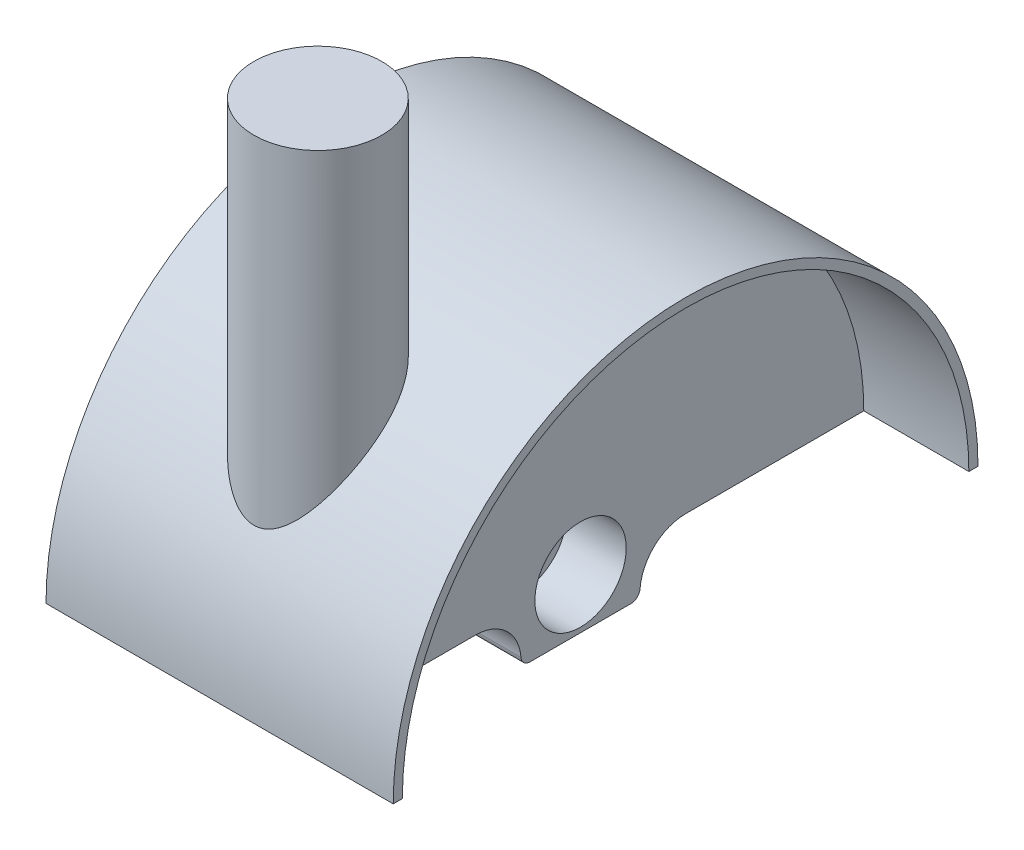
ISO-10303-21;
HEADER;
FILE_DESCRIPTION(('STEP AP214'),'2;1');
FILE_NAME('part.step','',(''),(''),'','','');
FILE_SCHEMA(('AUTOMOTIVE_DESIGN { 1 0 10303 214 1 1 1 1 }'));
ENDSEC;
DATA;
#1=APPLICATION_CONTEXT('core data for automotive mechanical design processes');
#2=APPLICATION_PROTOCOL_DEFINITION('international standard','automotive_design',2000,#1);
#3=PRODUCT_CONTEXT('',#1,'mechanical');
#4=PRODUCT('Part','Part','',(#3));
#5=PRODUCT_RELATED_PRODUCT_CATEGORY('part','',(#4));
#6=PRODUCT_DEFINITION_FORMATION('','',#4);
#7=PRODUCT_DEFINITION_CONTEXT('part definition',#1,'design');
#8=PRODUCT_DEFINITION('design','',#6,#7);
#9=PRODUCT_DEFINITION_SHAPE('','',#8);
#10=(LENGTH_UNIT() NAMED_UNIT(*) SI_UNIT(.MILLI.,.METRE.));
#11=(NAMED_UNIT(*) PLANE_ANGLE_UNIT() SI_UNIT($,.RADIAN.));
#12=(NAMED_UNIT(*) SI_UNIT($,.STERADIAN.) SOLID_ANGLE_UNIT());
#13=UNCERTAINTY_MEASURE_WITH_UNIT(LENGTH_MEASURE(1.E-05),#10,'distance_accuracy_value','');
#14=(GEOMETRIC_REPRESENTATION_CONTEXT(3) GLOBAL_UNCERTAINTY_ASSIGNED_CONTEXT((#13)) GLOBAL_UNIT_ASSIGNED_CONTEXT((#10,
#11,#12)) REPRESENTATION_CONTEXT('',''));
#15=CARTESIAN_POINT('',(0.,0.,0.));
#16=DIRECTION('',(0.,0.,1.));
#17=DIRECTION('',(1.,0.,0.));
#18=AXIS2_PLACEMENT_3D('',#15,#16,#17);
#19=CARTESIAN_POINT('',(0.,-5.,11.5));
#20=DIRECTION('',(-1.,0.,0.));
#21=DIRECTION('',(0.,0.,1.));
#22=AXIS2_PLACEMENT_3D('',#19,#20,#21);
#23=CYLINDRICAL_SURFACE('',#22,5.);
#24=CARTESIAN_POINT('',(-7.5,-5.,11.5));
#25=DIRECTION('',(-1.,0.,0.));
#26=DIRECTION('',(0.,0.,1.));
#27=AXIS2_PLACEMENT_3D('',#24,#25,#26);
#28=CIRCLE('',#27,5.);
#29=CARTESIAN_POINT('',(-7.5,0.,11.5));
#30=VERTEX_POINT('',#29);
#31=CARTESIAN_POINT('',(-7.5,-4.60772935195974,6.51541137718607));
#32=VERTEX_POINT('',#31);
#33=EDGE_CURVE('E206',#30,#32,#28,.T.);
#34=ORIENTED_EDGE('',*,*,#33,.T.);
#35=DIRECTION('',(-1.,0.,0.));
#36=VECTOR('',#35,1.);
#37=CARTESIAN_POINT('',(0.,-4.60772935195974,6.51541137718607));
#38=LINE('',#37,#36);
#39=CARTESIAN_POINT('',(7.5,-4.60772935195974,6.51541137718607));
#40=VERTEX_POINT('',#39);
#41=EDGE_CURVE('E209',#32,#40,#38,.F.);
#42=ORIENTED_EDGE('',*,*,#41,.T.);
#43=CARTESIAN_POINT('',(7.5,-5.,11.5));
#44=DIRECTION('',(1.,0.,0.));
#45=DIRECTION('',(0.,0.,-1.));
#46=AXIS2_PLACEMENT_3D('',#43,#44,#45);
#47=CIRCLE('',#46,5.);
#48=CARTESIAN_POINT('',(7.5,0.,11.5));
#49=VERTEX_POINT('',#48);
#50=EDGE_CURVE('E204',#40,#49,#47,.T.);
#51=ORIENTED_EDGE('',*,*,#50,.T.);
#52=DIRECTION('',(-1.,0.,0.));
#53=VECTOR('',#52,1.);
#54=CARTESIAN_POINT('',(19.,0.,11.5));
#55=LINE('',#54,#53);
#56=EDGE_CURVE('E201',#30,#49,#55,.F.);
#57=ORIENTED_EDGE('',*,*,#56,.F.);
#58=EDGE_LOOP('',(#34,#42,#51,#57));
#59=FACE_BOUND('',#58,.T.);
#60=ADVANCED_FACE('F35',(#59),#23,.F.);
#61=CARTESIAN_POINT('',(0.,-5.,-11.5));
#62=DIRECTION('',(-1.,0.,0.));
#63=DIRECTION('',(0.,0.,1.));
#64=AXIS2_PLACEMENT_3D('',#61,#62,#63);
#65=CYLINDRICAL_SURFACE('',#64,5.);
#66=CARTESIAN_POINT('',(7.5,-5.,-11.5));
#67=DIRECTION('',(1.,0.,0.));
#68=DIRECTION('',(0.,0.,-1.));
#69=AXIS2_PLACEMENT_3D('',#66,#67,#68);
#70=CIRCLE('',#69,5.);
#71=CARTESIAN_POINT('',(7.5,0.,-11.5));
#72=VERTEX_POINT('',#71);
#73=CARTESIAN_POINT('',(7.5,-4.60772935195974,-6.51541137718607));
#74=VERTEX_POINT('',#73);
#75=EDGE_CURVE('E199',#72,#74,#70,.T.);
#76=ORIENTED_EDGE('',*,*,#75,.T.);
#77=DIRECTION('',(-1.,0.,0.));
#78=VECTOR('',#77,1.);
#79=CARTESIAN_POINT('',(0.,-4.60772935195974,-6.51541137718607));
#80=LINE('',#79,#78);
#81=CARTESIAN_POINT('',(-7.5,-4.60772935195974,-6.51541137718607));
#82=VERTEX_POINT('',#81);
#83=EDGE_CURVE('E11',#74,#82,#80,.T.);
#84=ORIENTED_EDGE('',*,*,#83,.T.);
#85=CARTESIAN_POINT('',(-7.5,-5.,-11.5));
#86=DIRECTION('',(-1.,0.,0.));
#87=DIRECTION('',(0.,0.,1.));
#88=AXIS2_PLACEMENT_3D('',#85,#86,#87);
#89=CIRCLE('',#88,5.);
#90=CARTESIAN_POINT('',(-7.5,0.,-11.5));
#91=VERTEX_POINT('',#90);
#92=EDGE_CURVE('E197',#82,#91,#89,.T.);
#93=ORIENTED_EDGE('',*,*,#92,.T.);
#94=DIRECTION('',(1.,0.,0.));
#95=VECTOR('',#94,1.);
#96=CARTESIAN_POINT('',(0.,0.,-11.5));
#97=LINE('',#96,#95);
#98=EDGE_CURVE('E138',#72,#91,#97,.F.);
#99=ORIENTED_EDGE('',*,*,#98,.F.);
#100=EDGE_LOOP('',(#76,#84,#93,#99));
#101=FACE_BOUND('',#100,.T.);
#102=ADVANCED_FACE('F238',(#101),#65,.F.);
#103=CARTESIAN_POINT('',(19.,0.,0.));
#104=DIRECTION('',(0.,1.,0.));
#105=DIRECTION('',(0.,0.,1.));
#106=AXIS2_PLACEMENT_3D('',#103,#104,#105);
#107=PLANE('',#106);
#108=DIRECTION('',(0.,0.,-1.));
#109=VECTOR('',#108,1.);
#110=CARTESIAN_POINT('',(7.5,0.,0.));
#111=LINE('',#110,#109);
#112=CARTESIAN_POINT('',(7.5,0.,-31.));
#113=VERTEX_POINT('',#112);
#114=EDGE_CURVE('E171',#72,#113,#111,.T.);
#115=ORIENTED_EDGE('',*,*,#114,.F.);
#116=ORIENTED_EDGE('',*,*,#98,.T.);
#117=DIRECTION('',(0.,0.,-1.));
#118=VECTOR('',#117,1.);
#119=CARTESIAN_POINT('',(-7.5,0.,0.));
#120=LINE('',#119,#118);
#121=CARTESIAN_POINT('',(-7.5,0.,-31.));
#122=VERTEX_POINT('',#121);
#123=EDGE_CURVE('E130',#91,#122,#120,.T.);
#124=ORIENTED_EDGE('',*,*,#123,.T.);
#125=DIRECTION('',(1.,0.,0.));
#126=VECTOR('',#125,1.);
#127=CARTESIAN_POINT('',(-19.,0.,-31.));
#128=LINE('',#127,#126);
#129=CARTESIAN_POINT('',(-19.,0.,-31.));
#130=VERTEX_POINT('',#129);
#131=EDGE_CURVE('E136',#130,#122,#128,.T.);
#132=ORIENTED_EDGE('',*,*,#131,.F.);
#133=DIRECTION('',(0.,0.,-1.));
#134=VECTOR('',#133,1.);
#135=CARTESIAN_POINT('',(-19.,0.,0.));
#136=LINE('',#135,#134);
#137=CARTESIAN_POINT('',(-19.,0.,-32.));
#138=VERTEX_POINT('',#137);
#139=EDGE_CURVE('E150',#130,#138,#136,.T.);
#140=ORIENTED_EDGE('',*,*,#139,.T.);
#141=DIRECTION('',(-1.,0.,0.));
#142=VECTOR('',#141,1.);
#143=CARTESIAN_POINT('',(19.,0.,-32.));
#144=LINE('',#143,#142);
#145=CARTESIAN_POINT('',(19.,0.,-32.));
#146=VERTEX_POINT('',#145);
#147=EDGE_CURVE('E194',#146,#138,#144,.T.);
#148=ORIENTED_EDGE('',*,*,#147,.F.);
#149=DIRECTION('',(0.,0.,-1.));
#150=VECTOR('',#149,1.);
#151=CARTESIAN_POINT('',(19.,0.,0.));
#152=LINE('',#151,#150);
#153=CARTESIAN_POINT('',(19.,0.,-31.));
#154=VERTEX_POINT('',#153);
#155=EDGE_CURVE('E177',#154,#146,#152,.T.);
#156=ORIENTED_EDGE('',*,*,#155,.F.);
#157=DIRECTION('',(-1.,0.,0.));
#158=VECTOR('',#157,1.);
#159=CARTESIAN_POINT('',(19.,0.,-31.));
#160=LINE('',#159,#158);
#161=EDGE_CURVE('E186',#154,#113,#160,.T.);
#162=ORIENTED_EDGE('',*,*,#161,.T.);
#163=EDGE_LOOP('',(#115,#116,#124,#132,#140,#148,#156,#162));
#164=FACE_BOUND('',#163,.T.);
#165=ADVANCED_FACE('F133',(#164),#107,.F.);
#166=CARTESIAN_POINT('',(19.,0.,0.));
#167=DIRECTION('',(-1.,0.,0.));
#168=DIRECTION('',(0.,0.,1.));
#169=AXIS2_PLACEMENT_3D('',#166,#167,#168);
#170=CYLINDRICAL_SURFACE('',#169,32.);
#171=CARTESIAN_POINT('',(0.,15.0312175155574,28.25));
#172=CARTESIAN_POINT('',(-0.102155093027616,15.0312164653924,28.2500004624133));
#173=CARTESIAN_POINT('',(-0.204300523928058,15.0354353496864,28.2477571562009));
#174=CARTESIAN_POINT('',(-0.407732047794961,15.0521411105847,28.2388584510231));
#175=CARTESIAN_POINT('',(-0.509017855547507,15.0646306304235,28.2322016415334));
#176=CARTESIAN_POINT('',(-0.810595007197943,15.113990202744,28.2058287773547));
#177=CARTESIAN_POINT('',(-1.00847250346679,15.1627504763428,28.1797106256714));
#178=CARTESIAN_POINT('',(-1.44827926941997,15.3042545053188,28.1031636073284));
#179=CARTESIAN_POINT('',(-1.68649273640448,15.4056188473367,28.0479009300075));
#180=CARTESIAN_POINT('',(-2.14189060002036,15.6389286170325,27.9184824837892));
#181=CARTESIAN_POINT('',(-2.35902268554412,15.770947492148,27.8442812956847));
#182=CARTESIAN_POINT('',(-2.74221543034369,16.034364005941,27.6932980735991));
#183=CARTESIAN_POINT('',(-2.91107196082312,16.1629426293954,27.6185355700519));
#184=CARTESIAN_POINT('',(-3.23557003389156,16.4308952637491,27.4599695972697));
#185=CARTESIAN_POINT('',(-3.39120191753828,16.5702770253027,27.376159619719));
#186=CARTESIAN_POINT('',(-3.69069300493788,16.8570089687589,27.2005437547682));
#187=CARTESIAN_POINT('',(-3.83452936748117,17.0043737341061,27.1087230327889));
#188=CARTESIAN_POINT('',(-4.11122986822242,17.3047392127784,26.9179811869915));
#189=CARTESIAN_POINT('',(-4.24409035123991,17.4577417792676,26.8190577181565));
#190=CARTESIAN_POINT('',(-4.58989793716726,17.8771974963481,26.5425301393534));
#191=CARTESIAN_POINT('',(-4.79319698035417,18.1475164820144,26.3586656609386));
#192=CARTESIAN_POINT('',(-5.17311846479317,18.6945615941194,25.9735546564129));
#193=CARTESIAN_POINT('',(-5.34972399138255,18.9712916560093,25.7722972349402));
#194=CARTESIAN_POINT('',(-5.67754026344124,19.5278266052628,25.3532139433377));
#195=CARTESIAN_POINT('',(-5.82872180321128,19.8076346407645,25.1353694304124));
#196=CARTESIAN_POINT('',(-6.1054808869185,20.3672242298335,24.6841118466914));
#197=CARTESIAN_POINT('',(-6.23106437335009,20.6470057744418,24.450702405973));
#198=CARTESIAN_POINT('',(-6.45914470672475,21.2125426023899,23.9618819685192));
#199=CARTESIAN_POINT('',(-6.56085505788891,21.4982319568514,23.7060260935243));
#200=CARTESIAN_POINT('',(-6.73456287319925,22.0650311093743,23.1793886003867));
#201=CARTESIAN_POINT('',(-6.80655435193545,22.3461399739811,22.9086039880176));
#202=CARTESIAN_POINT('',(-6.91814038034908,22.9007825537903,22.3541401017234));
#203=CARTESIAN_POINT('',(-6.95780792136963,23.1743319809449,22.0704914153047));
#204=CARTESIAN_POINT('',(-7.00183167748729,23.7119858009423,21.491799675674));
#205=CARTESIAN_POINT('',(-7.00620679478726,23.9760951742899,21.1967628069317));
#206=CARTESIAN_POINT('',(-6.9809816563698,24.4075483805127,20.6964308691207));
#207=CARTESIAN_POINT('',(-6.96205165129114,24.5782246911239,20.4934317974739));
#208=CARTESIAN_POINT('',(-6.90542752430888,24.9132238503909,20.0848446728331));
#209=CARTESIAN_POINT('',(-6.86773816741038,25.0775483010463,19.879257290207));
#210=CARTESIAN_POINT('',(-6.77246076480338,25.3987636114429,19.4671775641788));
#211=CARTESIAN_POINT('',(-6.71489147207308,25.5556613188813,19.2606862540611));
#212=CARTESIAN_POINT('',(-6.57873887468179,25.861176367945,18.8484832763706));
#213=CARTESIAN_POINT('',(-6.50015861233291,26.0097949046027,18.6427715002941));
#214=CARTESIAN_POINT('',(-6.33609099615255,26.2735478582061,18.2686604489508));
#215=CARTESIAN_POINT('',(-6.25397417167975,26.3901168003916,18.0997913264326));
#216=CARTESIAN_POINT('',(-6.07416219549023,26.6161886285133,17.765673744962));
#217=CARTESIAN_POINT('',(-5.97647017194776,26.7256929271454,17.6004245665323));
#218=CARTESIAN_POINT('',(-5.76528258032364,26.9370637910296,17.2751907170174));
#219=CARTESIAN_POINT('',(-5.65178674935906,27.038930229189,17.115206133559));
#220=CARTESIAN_POINT('',(-5.40900891231386,27.2344627957078,16.8023233986199));
#221=CARTESIAN_POINT('',(-5.27972665601877,27.3281287940501,16.6494253595138));
#222=CARTESIAN_POINT('',(-5.00470876892491,27.5073695407553,16.3516068053352));
#223=CARTESIAN_POINT('',(-4.85886387560525,27.5928827885086,16.2067499179205));
#224=CARTESIAN_POINT('',(-4.55208335397074,27.7546049750001,15.9282092118256));
#225=CARTESIAN_POINT('',(-4.39114731936437,27.8308136631089,15.794525694144));
#226=CARTESIAN_POINT('',(-4.05522618480725,27.9735062779978,15.5404049089976));
#227=CARTESIAN_POINT('',(-3.88024708564405,28.0399943246258,15.4199620352215));
#228=CARTESIAN_POINT('',(-3.5174977469524,28.1629741758704,15.1941904393848));
#229=CARTESIAN_POINT('',(-3.32972939417015,28.2194674505701,15.0888594950146));
#230=CARTESIAN_POINT('',(-2.9671233969476,28.315840160452,14.9071265427654));
#231=CARTESIAN_POINT('',(-2.79358576415381,28.3569123157116,14.8287555839504));
#232=CARTESIAN_POINT('',(-2.4392313503208,28.431128635831,14.6859594731508));
#233=CARTESIAN_POINT('',(-2.25841518401468,28.4642734685852,14.6215331463437));
#234=CARTESIAN_POINT('',(-1.89098855286482,28.5225562501359,14.5075114415909));
#235=CARTESIAN_POINT('',(-1.70438037568572,28.547697317095,14.4579102884128));
#236=CARTESIAN_POINT('',(-1.32683291727703,28.5899483177981,14.3741803625648));
#237=CARTESIAN_POINT('',(-1.13589382243696,28.6070585964779,14.3400509253611));
#238=CARTESIAN_POINT('',(-0.765695314417943,28.6322470257356,14.2896870694615));
#239=CARTESIAN_POINT('',(-0.586630279050031,28.6409049341241,14.2723052815942));
#240=CARTESIAN_POINT('',(-0.227496603038627,28.651319838641,14.2513862851951));
#241=CARTESIAN_POINT('',(-0.0474280065008665,28.6530771356877,14.2478484729621));
#242=CARTESIAN_POINT('',(0.312344677349705,28.6496899247536,14.2546582100856));
#243=CARTESIAN_POINT('',(0.492048828895484,28.6445467625763,14.2650030518945));
#244=CARTESIAN_POINT('',(0.849801619059963,28.6273657037662,14.2994511254505));
#245=CARTESIAN_POINT('',(1.02785025422365,28.6153277927477,14.3235543859047));
#246=CARTESIAN_POINT('',(1.3774949487551,28.584676228431,14.3846245986633));
#247=CARTESIAN_POINT('',(1.54914898771312,28.5661972466382,14.4213278854322));
#248=CARTESIAN_POINT('',(1.88849121760134,28.5226416843084,14.5072819933609));
#249=CARTESIAN_POINT('',(2.05617806256526,28.4975628986458,14.556537008128));
#250=CARTESIAN_POINT('',(2.38637121590816,28.4408539554246,14.6670268771017));
#251=CARTESIAN_POINT('',(2.54887867805878,28.4092252688751,14.7282590412499));
#252=CARTESIAN_POINT('',(2.86772749762996,28.3394681051772,14.8620400506055));
#253=CARTESIAN_POINT('',(3.0240685258863,28.3013392816281,14.9345894989081));
#254=CARTESIAN_POINT('',(3.33260815231858,28.2178615409462,15.0917313067835));
#255=CARTESIAN_POINT('',(3.4846676539507,28.1723869644082,15.1765298972791));
#256=CARTESIAN_POINT('',(3.78053884961631,28.0748842545054,15.3561489964457));
#257=CARTESIAN_POINT('',(3.92435030654491,28.0228559328787,15.4509697930004));
#258=CARTESIAN_POINT('',(4.20298384460769,27.9124013312446,15.6496249767747));
#259=CARTESIAN_POINT('',(4.33780658976681,27.8539755246844,15.7534586968733));
#260=CARTESIAN_POINT('',(4.59793499462354,27.7308889105666,15.9691333428193));
#261=CARTESIAN_POINT('',(4.7232372806637,27.6662259110569,16.0809770800647));
#262=CARTESIAN_POINT('',(4.97138936543172,27.5266535013527,16.318808899781));
#263=CARTESIAN_POINT('',(5.09359208782062,27.4513557672788,16.4452441469906));
#264=CARTESIAN_POINT('',(5.32638958810438,27.2942628146549,16.7046766083588));
#265=CARTESIAN_POINT('',(5.4369800755331,27.2124652140198,16.8376762214119));
#266=CARTESIAN_POINT('',(5.64631983290795,27.0427428390627,17.1089347905739));
#267=CARTESIAN_POINT('',(5.74507038837062,26.9548187315662,17.2471931735626));
#268=CARTESIAN_POINT('',(5.93075702084578,26.7731703058578,17.5278437639054));
#269=CARTESIAN_POINT('',(6.01768880736692,26.6794438991492,17.6702374498268));
#270=CARTESIAN_POINT('',(6.1895822890243,26.4749754763646,17.9753531956886));
#271=CARTESIAN_POINT('',(6.27304519577036,26.3635437966471,18.1384577690398));
#272=CARTESIAN_POINT('',(6.42558021432577,26.1344182475334,18.4670606841141));
#273=CARTESIAN_POINT('',(6.49464645473722,26.0167218476631,18.632559973164));
#274=CARTESIAN_POINT('',(6.61882009076025,25.7756239279966,18.9646861900169));
#275=CARTESIAN_POINT('',(6.6739241227533,25.6522210419089,19.1313133796334));
#276=CARTESIAN_POINT('',(6.77070404368298,25.4002644262708,19.4645896093726));
#277=CARTESIAN_POINT('',(6.81237724066179,25.2717096699233,19.6312386471865));
#278=CARTESIAN_POINT('',(6.89978712826283,24.9472148960242,20.0433100437522));
#279=CARTESIAN_POINT('',(6.93789675924109,24.748511636171,20.2882017796683));
#280=CARTESIAN_POINT('',(6.9880301066507,24.342552999481,20.7735489504402));
#281=CARTESIAN_POINT('',(7.00004419692743,24.1352944954935,21.0140027157935));
#282=CARTESIAN_POINT('',(6.99995548264263,23.7133526625722,21.4890202993264));
#283=CARTESIAN_POINT('',(6.98780974298868,23.4986567827212,21.7235728802145));
#284=CARTESIAN_POINT('',(6.94115409557793,23.0635671038359,22.1849605357031));
#285=CARTESIAN_POINT('',(6.90664446539812,22.8431733755549,22.4117957060539));
#286=CARTESIAN_POINT('',(6.80514253905018,22.3397210403584,22.9149378402833));
#287=CARTESIAN_POINT('',(6.73201956984452,22.0553331332443,23.1886878723856));
#288=CARTESIAN_POINT('',(6.55535949335649,21.4817653482889,23.7210238713391));
#289=CARTESIAN_POINT('',(6.45181174057725,21.1925838266576,23.9796044924256));
#290=CARTESIAN_POINT('',(6.21599663245549,20.6115725930567,24.4808175672518));
#291=CARTESIAN_POINT('',(6.08369918278495,20.3197404155225,24.7234329597181));
#292=CARTESIAN_POINT('',(5.79139488183317,19.7363869652657,25.1915613741123));
#293=CARTESIAN_POINT('',(5.63139778894773,19.4448656193082,25.4170803788847));
#294=CARTESIAN_POINT('',(5.3287841919544,18.9407203992278,25.7938130185683));
#295=CARTESIAN_POINT('',(5.1924866179934,18.7273144246458,25.9490865381301));
#296=CARTESIAN_POINT('',(4.90399545954869,18.3039670051579,26.2494210617444));
#297=CARTESIAN_POINT('',(4.75179953539074,18.0940260754632,26.3944805573807));
#298=CARTESIAN_POINT('',(4.43104349350646,17.6805973562491,26.6731773822846));
#299=CARTESIAN_POINT('',(4.262543619634,17.4770892376491,26.8068535708425));
#300=CARTESIAN_POINT('',(3.90713752826817,17.0789617083393,27.0622409375213));
#301=CARTESIAN_POINT('',(3.72024426052953,16.8843361832148,27.1839604147492));
#302=CARTESIAN_POINT('',(3.33497021094366,16.5174502993183,27.4083537771082));
#303=CARTESIAN_POINT('',(3.13755748395996,16.3445666236899,27.5116578824189));
#304=CARTESIAN_POINT('',(2.72063288270414,16.0168100003854,27.7037503165164));
#305=CARTESIAN_POINT('',(2.50108488796822,15.86196740947,27.7925142783976));
#306=CARTESIAN_POINT('',(2.15201063647585,15.6498740178137,27.9121529415217));
#307=CARTESIAN_POINT('',(2.03127501766774,15.5820623599002,27.9500373932973));
#308=CARTESIAN_POINT('',(1.78347753695898,15.4555116281793,28.020213641863));
#309=CARTESIAN_POINT('',(1.65641440590889,15.3967743842558,28.0525043108081));
#310=CARTESIAN_POINT('',(1.39687439072311,15.2906499214217,28.1104905294899));
#311=CARTESIAN_POINT('',(1.2644263393567,15.2432097070846,28.136216915262));
#312=CARTESIAN_POINT('',(0.994434621436776,15.1614640334422,28.1803509379846));
#313=CARTESIAN_POINT('',(0.856896605637685,15.1271444608811,28.1987664397325));
#314=CARTESIAN_POINT('',(0.599767202713953,15.0776383043967,28.2252632017631));
#315=CARTESIAN_POINT('',(0.480708246554892,15.0603072737804,28.2345056674477));
#316=CARTESIAN_POINT('',(0.241095359282437,15.0370956301428,28.2468747918975));
#317=CARTESIAN_POINT('',(0.120540953097819,15.0312187547309,28.2499994543616));
#318=CARTESIAN_POINT('',(0.,15.0312175155574,28.25));
#319=B_SPLINE_CURVE_WITH_KNOTS('',3,(#171,#172,#173,#174,#175,#176,#177,#178,#179,#180,#181,
#182,#183,#184,#185,#186,#187,#188,#189,#190,#191,#192,#193,#194,#195,#196,#197,#198,#199,#200,
#201,#202,#203,#204,#205,#206,#207,#208,#209,#210,#211,#212,#213,#214,#215,#216,#217,#218,#219,
#220,#221,#222,#223,#224,#225,#226,#227,#228,#229,#230,#231,#232,#233,#234,#235,#236,#237,#238,
#239,#240,#241,#242,#243,#244,#245,#246,#247,#248,#249,#250,#251,#252,#253,#254,#255,#256,#257,
#258,#259,#260,#261,#262,#263,#264,#265,#266,#267,#268,#269,#270,#271,#272,#273,#274,#275,#276,
#277,#278,#279,#280,#281,#282,#283,#284,#285,#286,#287,#288,#289,#290,#291,#292,#293,#294,#295,
#296,#297,#298,#299,#300,#301,#302,#303,#304,#305,#306,#307,#308,#309,#310,#311,#312,#313,#314,
#315,#316,#317,#318),.UNSPECIFIED.,.T.,.F.,(4,2,2,2,2,2,2,2,2,2,2,2,2,2,2,2,2,2,2,2,2,2,2,2,2,2,
2,2,2,2,2,2,2,2,2,2,2,2,2,2,2,2,2,2,2,2,2,2,2,2,2,2,2,2,2,2,2,2,2,2,2,2,2,2,2,2,2,2,2,2,2,2,2,
4),(0.,0.306331163410182,0.612760275300662,1.22601322370596,2.01579495495083,2.80748887244249,
3.48161715421053,4.15623364411821,4.83212706448963,5.50824467065167,6.66149222464223,
7.81546751128725,8.97075949870264,10.1257829830908,11.3147338010742,12.5039239582278,
13.6904212807891,14.8762830872598,15.6732957948913,16.4701061590176,17.2661669265377,
18.062112489711,18.7245235617506,19.3868017601805,20.0490909763626,20.7113906911755,
21.3783456735493,22.0453186171881,22.7120080566231,23.3785993542368,23.9622113008819,
24.5457740596082,25.1291091909004,25.7124192646784,26.2521078992358,26.7917729990558,
27.3313328627556,27.8708938522497,28.3997904733987,28.9288640342772,29.4578189018091,
29.9868019668404,30.5260417522493,31.0652970313147,31.6045124296227,32.1439180209727,
32.717165294229,33.2906236299672,33.8640196461729,34.4376232659633,35.0803241238446,
35.7232865840367,36.3664037925706,37.0096498217839,37.9612246722849,38.913150481297,
39.8667694949978,40.8203766727604,42.0231079670319,43.2262605938102,44.4306787641968,
45.6346734864875,46.5252260090205,47.4159097744846,48.303419721822,49.1903092334668,
50.0350496596806,50.8811915620133,51.3114572814945,51.7418096524729,52.1701015739033,
52.5979314969491,52.9592782110011,53.3207428165009),.UNSPECIFIED.);
#320=CARTESIAN_POINT('',(0.,15.0312175155574,28.25));
#321=VERTEX_POINT('',#320);
#322=EDGE_CURVE('E39',#321,#321,#319,.T.);
#323=ORIENTED_EDGE('',*,*,#322,.T.);
#324=EDGE_LOOP('',(#323));
#325=FACE_BOUND('',#324,.T.);
#326=ORIENTED_EDGE('',*,*,#147,.T.);
#327=CARTESIAN_POINT('',(-19.,0.,0.));
#328=DIRECTION('',(1.,0.,0.));
#329=DIRECTION('',(0.,0.,-1.));
#330=AXIS2_PLACEMENT_3D('',#327,#328,#329);
#331=CIRCLE('',#330,32.);
#332=CARTESIAN_POINT('',(-19.,0.,32.));
#333=VERTEX_POINT('',#332);
#334=EDGE_CURVE('E253',#138,#333,#331,.T.);
#335=ORIENTED_EDGE('',*,*,#334,.T.);
#336=DIRECTION('',(-1.,0.,0.));
#337=VECTOR('',#336,1.);
#338=CARTESIAN_POINT('',(19.,0.,32.));
#339=LINE('',#338,#337);
#340=CARTESIAN_POINT('',(19.,0.,32.));
#341=VERTEX_POINT('',#340);
#342=EDGE_CURVE('E192',#341,#333,#339,.T.);
#343=ORIENTED_EDGE('',*,*,#342,.F.);
#344=CARTESIAN_POINT('',(19.,0.,0.));
#345=DIRECTION('',(1.,0.,0.));
#346=DIRECTION('',(0.,0.,-1.));
#347=AXIS2_PLACEMENT_3D('',#344,#345,#346);
#348=CIRCLE('',#347,32.);
#349=EDGE_CURVE('E180',#146,#341,#348,.T.);
#350=ORIENTED_EDGE('',*,*,#349,.F.);
#351=EDGE_LOOP('',(#326,#335,#343,#350));
#352=FACE_BOUND('',#351,.T.);
#353=ADVANCED_FACE('F262',(#325,#352),#170,.T.);
#354=CARTESIAN_POINT('',(-7.5,0.,31.));
#355=VERTEX_POINT('',#354);
#356=EDGE_CURVE('E139',#355,#30,#120,.T.);
#357=ORIENTED_EDGE('',*,*,#356,.T.);
#358=ORIENTED_EDGE('',*,*,#56,.T.);
#359=CARTESIAN_POINT('',(7.5,0.,31.));
#360=VERTEX_POINT('',#359);
#361=EDGE_CURVE('E172',#360,#49,#111,.T.);
#362=ORIENTED_EDGE('',*,*,#361,.F.);
#363=DIRECTION('',(-1.,0.,0.));
#364=VECTOR('',#363,1.);
#365=CARTESIAN_POINT('',(19.,0.,31.));
#366=LINE('',#365,#364);
#367=CARTESIAN_POINT('',(19.,0.,31.));
#368=VERTEX_POINT('',#367);
#369=EDGE_CURVE('E189',#368,#360,#366,.T.);
#370=ORIENTED_EDGE('',*,*,#369,.F.);
#371=EDGE_CURVE('E181',#341,#368,#152,.T.);
#372=ORIENTED_EDGE('',*,*,#371,.F.);
#373=ORIENTED_EDGE('',*,*,#342,.T.);
#374=CARTESIAN_POINT('',(-19.,0.,31.));
#375=VERTEX_POINT('',#374);
#376=EDGE_CURVE('E159',#333,#375,#136,.T.);
#377=ORIENTED_EDGE('',*,*,#376,.T.);
#378=DIRECTION('',(1.,0.,0.));
#379=VECTOR('',#378,1.);
#380=CARTESIAN_POINT('',(-19.,0.,31.));
#381=LINE('',#380,#379);
#382=EDGE_CURVE('E155',#375,#355,#381,.T.);
#383=ORIENTED_EDGE('',*,*,#382,.T.);
#384=EDGE_LOOP('',(#357,#358,#362,#370,#372,#373,#377,#383));
#385=FACE_BOUND('',#384,.T.);
#386=ADVANCED_FACE('F248',(#385),#107,.F.);
#387=CARTESIAN_POINT('',(19.,0.,0.));
#388=DIRECTION('',(-1.,0.,0.));
#389=DIRECTION('',(0.,0.,1.));
#390=AXIS2_PLACEMENT_3D('',#387,#388,#389);
#391=CYLINDRICAL_SURFACE('',#390,31.);
#392=CARTESIAN_POINT('',(7.5,0.,0.));
#393=DIRECTION('',(1.,0.,0.));
#394=DIRECTION('',(0.,0.,-1.));
#395=AXIS2_PLACEMENT_3D('',#392,#393,#394);
#396=CIRCLE('',#395,31.);
#397=EDGE_CURVE('E175',#113,#360,#396,.T.);
#398=ORIENTED_EDGE('',*,*,#397,.F.);
#399=ORIENTED_EDGE('',*,*,#161,.F.);
#400=CARTESIAN_POINT('',(19.,0.,0.));
#401=DIRECTION('',(1.,0.,0.));
#402=DIRECTION('',(0.,0.,-1.));
#403=AXIS2_PLACEMENT_3D('',#400,#401,#402);
#404=CIRCLE('',#403,31.);
#405=EDGE_CURVE('E183',#154,#368,#404,.T.);
#406=ORIENTED_EDGE('',*,*,#405,.T.);
#407=ORIENTED_EDGE('',*,*,#369,.T.);
#408=EDGE_LOOP('',(#398,#399,#406,#407));
#409=FACE_BOUND('',#408,.T.);
#410=ADVANCED_FACE('F243',(#409),#391,.F.);
#411=CARTESIAN_POINT('',(19.,0.,0.));
#412=DIRECTION('',(1.,0.,0.));
#413=DIRECTION('',(0.,0.,-1.));
#414=AXIS2_PLACEMENT_3D('',#411,#412,#413);
#415=PLANE('',#414);
#416=ORIENTED_EDGE('',*,*,#155,.T.);
#417=ORIENTED_EDGE('',*,*,#349,.T.);
#418=ORIENTED_EDGE('',*,*,#371,.T.);
#419=ORIENTED_EDGE('',*,*,#405,.F.);
#420=EDGE_LOOP('',(#416,#417,#418,#419));
#421=FACE_BOUND('',#420,.T.);
#422=ADVANCED_FACE('F264',(#421),#415,.T.);
#423=CARTESIAN_POINT('',(7.5,0.,0.));
#424=DIRECTION('',(1.,0.,0.));
#425=DIRECTION('',(0.,0.,-1.));
#426=AXIS2_PLACEMENT_3D('',#423,#424,#425);
#427=PLANE('',#426);
#428=ORIENTED_EDGE('',*,*,#50,.F.);
#429=CARTESIAN_POINT('',(7.5,-4.52927522235169,5.51849365262328));
#430=DIRECTION('',(1.,0.,0.));
#431=DIRECTION('',(0.,0.,-1.));
#432=AXIS2_PLACEMENT_3D('',#429,#430,#431);
#433=CIRCLE('',#432,1.);
#434=CARTESIAN_POINT('',(7.5,-5.52927522235169,5.51849365262328));
#435=VERTEX_POINT('',#434);
#436=EDGE_CURVE('E214',#40,#435,#433,.T.);
#437=ORIENTED_EDGE('',*,*,#436,.T.);
#438=DIRECTION('',(0.,0.,-1.));
#439=VECTOR('',#438,1.);
#440=CARTESIAN_POINT('',(7.5,-5.52927522235169,0.));
#441=LINE('',#440,#439);
#442=CARTESIAN_POINT('',(7.5,-5.52927522235169,-5.51849365262329));
#443=VERTEX_POINT('',#442);
#444=EDGE_CURVE('E166',#435,#443,#441,.T.);
#445=ORIENTED_EDGE('',*,*,#444,.T.);
#446=CARTESIAN_POINT('',(7.5,-4.52927522235169,-5.51849365262329));
#447=DIRECTION('',(1.,0.,0.));
#448=DIRECTION('',(0.,0.,-1.));
#449=AXIS2_PLACEMENT_3D('',#446,#447,#448);
#450=CIRCLE('',#449,1.);
#451=EDGE_CURVE('E212',#443,#74,#450,.T.);
#452=ORIENTED_EDGE('',*,*,#451,.T.);
#453=ORIENTED_EDGE('',*,*,#75,.F.);
#454=ORIENTED_EDGE('',*,*,#114,.T.);
#455=ORIENTED_EDGE('',*,*,#397,.T.);
#456=ORIENTED_EDGE('',*,*,#361,.T.);
#457=EDGE_LOOP('',(#428,#437,#445,#452,#453,#454,#455,#456));
#458=FACE_BOUND('',#457,.T.);
#459=CARTESIAN_POINT('',(7.5,0.,0.));
#460=DIRECTION('',(1.,0.,0.));
#461=DIRECTION('',(0.,0.,-1.));
#462=AXIS2_PLACEMENT_3D('',#459,#460,#461);
#463=CIRCLE('',#462,5.);
#464=CARTESIAN_POINT('',(7.5,0.,-5.));
#465=VERTEX_POINT('',#464);
#466=EDGE_CURVE('E157',#465,#465,#463,.T.);
#467=ORIENTED_EDGE('',*,*,#466,.F.);
#468=EDGE_LOOP('',(#467));
#469=FACE_BOUND('',#468,.T.);
#470=ADVANCED_FACE('F232',(#458,#469),#427,.T.);
#471=CARTESIAN_POINT('',(0.,-5.52927522235169,0.));
#472=DIRECTION('',(0.,-1.,0.));
#473=DIRECTION('',(0.,0.,-1.));
#474=AXIS2_PLACEMENT_3D('',#471,#472,#473);
#475=PLANE('',#474);
#476=ORIENTED_EDGE('',*,*,#444,.F.);
#477=DIRECTION('',(1.,0.,0.));
#478=VECTOR('',#477,1.);
#479=CARTESIAN_POINT('',(-7.5,-5.52927522235169,5.51849365262328));
#480=LINE('',#479,#478);
#481=CARTESIAN_POINT('',(-7.5,-5.52927522235169,5.51849365262328));
#482=VERTEX_POINT('',#481);
#483=EDGE_CURVE('E219',#435,#482,#480,.F.);
#484=ORIENTED_EDGE('',*,*,#483,.T.);
#485=DIRECTION('',(0.,0.,-1.));
#486=VECTOR('',#485,1.);
#487=CARTESIAN_POINT('',(-7.5,-5.52927522235169,0.));
#488=LINE('',#487,#486);
#489=CARTESIAN_POINT('',(-7.5,-5.52927522235169,-5.51849365262329));
#490=VERTEX_POINT('',#489);
#491=EDGE_CURVE('E140',#482,#490,#488,.T.);
#492=ORIENTED_EDGE('',*,*,#491,.T.);
#493=DIRECTION('',(1.,0.,0.));
#494=VECTOR('',#493,1.);
#495=CARTESIAN_POINT('',(7.5,-5.52927522235169,-5.51849365262329));
#496=LINE('',#495,#494);
#497=EDGE_CURVE('E216',#490,#443,#496,.T.);
#498=ORIENTED_EDGE('',*,*,#497,.T.);
#499=EDGE_LOOP('',(#476,#484,#492,#498));
#500=FACE_BOUND('',#499,.T.);
#501=ADVANCED_FACE('F235',(#500),#475,.T.);
#502=CARTESIAN_POINT('',(0.999999999999999,0.,0.));
#503=DIRECTION('',(1.,0.,0.));
#504=DIRECTION('',(0.,0.,-1.));
#505=AXIS2_PLACEMENT_3D('',#502,#503,#504);
#506=CYLINDRICAL_SURFACE('',#505,5.);
#507=CARTESIAN_POINT('',(0.999999999999999,0.,0.));
#508=DIRECTION('',(1.,0.,0.));
#509=DIRECTION('',(0.,0.,-1.));
#510=AXIS2_PLACEMENT_3D('',#507,#508,#509);
#511=CIRCLE('',#510,5.);
#512=CARTESIAN_POINT('',(0.999999999999999,0.,-5.));
#513=VERTEX_POINT('',#512);
#514=EDGE_CURVE('E163',#513,#513,#511,.T.);
#515=ORIENTED_EDGE('',*,*,#514,.F.);
#516=EDGE_LOOP('',(#515));
#517=FACE_BOUND('',#516,.T.);
#518=ORIENTED_EDGE('',*,*,#466,.T.);
#519=EDGE_LOOP('',(#518));
#520=FACE_BOUND('',#519,.T.);
#521=ADVANCED_FACE('F307',(#517,#520),#506,.F.);
#522=CARTESIAN_POINT('',(0.999999999999999,0.,0.));
#523=DIRECTION('',(1.,0.,0.));
#524=DIRECTION('',(0.,0.,-1.));
#525=AXIS2_PLACEMENT_3D('',#522,#523,#524);
#526=PLANE('',#525);
#527=ORIENTED_EDGE('',*,*,#514,.T.);
#528=EDGE_LOOP('',(#527));
#529=FACE_BOUND('',#528,.T.);
#530=ADVANCED_FACE('F304',(#529),#526,.T.);
#531=CARTESIAN_POINT('',(-19.,0.,0.));
#532=DIRECTION('',(1.,0.,0.));
#533=DIRECTION('',(0.,0.,1.));
#534=AXIS2_PLACEMENT_3D('',#531,#532,#533);
#535=CYLINDRICAL_SURFACE('',#534,31.);
#536=CARTESIAN_POINT('',(-7.5,0.,0.));
#537=DIRECTION('',(1.,0.,0.));
#538=DIRECTION('',(0.,0.,-1.));
#539=AXIS2_PLACEMENT_3D('',#536,#537,#538);
#540=CIRCLE('',#539,31.);
#541=EDGE_CURVE('E143',#122,#355,#540,.T.);
#542=ORIENTED_EDGE('',*,*,#541,.T.);
#543=ORIENTED_EDGE('',*,*,#382,.F.);
#544=CARTESIAN_POINT('',(-19.,0.,0.));
#545=DIRECTION('',(1.,0.,0.));
#546=DIRECTION('',(0.,0.,-1.));
#547=AXIS2_PLACEMENT_3D('',#544,#545,#546);
#548=CIRCLE('',#547,31.);
#549=EDGE_CURVE('E153',#130,#375,#548,.T.);
#550=ORIENTED_EDGE('',*,*,#549,.F.);
#551=ORIENTED_EDGE('',*,*,#131,.T.);
#552=EDGE_LOOP('',(#542,#543,#550,#551));
#553=FACE_BOUND('',#552,.T.);
#554=ADVANCED_FACE('F152',(#553),#535,.F.);
#555=CARTESIAN_POINT('',(-19.,0.,0.));
#556=DIRECTION('',(-1.,0.,0.));
#557=DIRECTION('',(0.,0.,-1.));
#558=AXIS2_PLACEMENT_3D('',#555,#556,#557);
#559=PLANE('',#558);
#560=ORIENTED_EDGE('',*,*,#139,.F.);
#561=ORIENTED_EDGE('',*,*,#549,.T.);
#562=ORIENTED_EDGE('',*,*,#376,.F.);
#563=ORIENTED_EDGE('',*,*,#334,.F.);
#564=EDGE_LOOP('',(#560,#561,#562,#563));
#565=FACE_BOUND('',#564,.T.);
#566=ADVANCED_FACE('F260',(#565),#559,.T.);
#567=CARTESIAN_POINT('',(-7.5,0.,0.));
#568=DIRECTION('',(-1.,0.,0.));
#569=DIRECTION('',(0.,0.,-1.));
#570=AXIS2_PLACEMENT_3D('',#567,#568,#569);
#571=PLANE('',#570);
#572=ORIENTED_EDGE('',*,*,#491,.F.);
#573=CARTESIAN_POINT('',(-7.5,-4.52927522235169,5.51849365262328));
#574=DIRECTION('',(-1.,0.,0.));
#575=DIRECTION('',(0.,0.,1.));
#576=AXIS2_PLACEMENT_3D('',#573,#574,#575);
#577=CIRCLE('',#576,1.);
#578=EDGE_CURVE('E48',#482,#32,#577,.T.);
#579=ORIENTED_EDGE('',*,*,#578,.T.);
#580=ORIENTED_EDGE('',*,*,#33,.F.);
#581=ORIENTED_EDGE('',*,*,#356,.F.);
#582=ORIENTED_EDGE('',*,*,#541,.F.);
#583=ORIENTED_EDGE('',*,*,#123,.F.);
#584=ORIENTED_EDGE('',*,*,#92,.F.);
#585=CARTESIAN_POINT('',(-7.5,-4.52927522235169,-5.51849365262329));
#586=DIRECTION('',(-1.,0.,0.));
#587=DIRECTION('',(0.,0.,1.));
#588=AXIS2_PLACEMENT_3D('',#585,#586,#587);
#589=CIRCLE('',#588,1.);
#590=EDGE_CURVE('E60',#82,#490,#589,.T.);
#591=ORIENTED_EDGE('',*,*,#590,.T.);
#592=EDGE_LOOP('',(#572,#579,#580,#581,#582,#583,#584,#591));
#593=FACE_BOUND('',#592,.T.);
#594=CARTESIAN_POINT('',(-7.5,0.,0.));
#595=DIRECTION('',(1.,0.,0.));
#596=DIRECTION('',(0.,0.,-1.));
#597=AXIS2_PLACEMENT_3D('',#594,#595,#596);
#598=CIRCLE('',#597,5.);
#599=CARTESIAN_POINT('',(-7.5,0.,-5.));
#600=VERTEX_POINT('',#599);
#601=EDGE_CURVE('E480',#600,#600,#598,.T.);
#602=ORIENTED_EDGE('',*,*,#601,.T.);
#603=EDGE_LOOP('',(#602));
#604=FACE_BOUND('',#603,.T.);
#605=ADVANCED_FACE('F144',(#593,#604),#571,.T.);
#606=CARTESIAN_POINT('',(-0.999999999999999,0.,0.));
#607=DIRECTION('',(-1.,0.,0.));
#608=DIRECTION('',(0.,0.,-1.));
#609=AXIS2_PLACEMENT_3D('',#606,#607,#608);
#610=CYLINDRICAL_SURFACE('',#609,5.);
#611=CARTESIAN_POINT('',(-0.999999999999999,0.,0.));
#612=DIRECTION('',(1.,0.,0.));
#613=DIRECTION('',(0.,0.,-1.));
#614=AXIS2_PLACEMENT_3D('',#611,#612,#613);
#615=CIRCLE('',#614,5.);
#616=CARTESIAN_POINT('',(-0.999999999999999,0.,-5.));
#617=VERTEX_POINT('',#616);
#618=EDGE_CURVE('E482',#617,#617,#615,.T.);
#619=ORIENTED_EDGE('',*,*,#618,.T.);
#620=EDGE_LOOP('',(#619));
#621=FACE_BOUND('',#620,.T.);
#622=ORIENTED_EDGE('',*,*,#601,.F.);
#623=EDGE_LOOP('',(#622));
#624=FACE_BOUND('',#623,.T.);
#625=ADVANCED_FACE('F286',(#621,#624),#610,.F.);
#626=CARTESIAN_POINT('',(-0.999999999999999,0.,0.));
#627=DIRECTION('',(-1.,0.,0.));
#628=DIRECTION('',(0.,0.,-1.));
#629=AXIS2_PLACEMENT_3D('',#626,#627,#628);
#630=PLANE('',#629);
#631=ORIENTED_EDGE('',*,*,#618,.F.);
#632=EDGE_LOOP('',(#631));
#633=FACE_BOUND('',#632,.T.);
#634=ADVANCED_FACE('F280',(#633),#630,.T.);
#635=CARTESIAN_POINT('',(0.,-4.52927522235169,5.51849365262328));
#636=DIRECTION('',(-1.,0.,0.));
#637=DIRECTION('',(0.,0.,1.));
#638=AXIS2_PLACEMENT_3D('',#635,#636,#637);
#639=CYLINDRICAL_SURFACE('',#638,1.);
#640=ORIENTED_EDGE('',*,*,#578,.F.);
#641=ORIENTED_EDGE('',*,*,#483,.F.);
#642=ORIENTED_EDGE('',*,*,#436,.F.);
#643=ORIENTED_EDGE('',*,*,#41,.F.);
#644=EDGE_LOOP('',(#640,#641,#642,#643));
#645=FACE_BOUND('',#644,.T.);
#646=ADVANCED_FACE('F229',(#645),#639,.T.);
#647=CARTESIAN_POINT('',(0.,-4.52927522235169,-5.51849365262329));
#648=DIRECTION('',(-1.,0.,0.));
#649=DIRECTION('',(0.,0.,1.));
#650=AXIS2_PLACEMENT_3D('',#647,#648,#649);
#651=CYLINDRICAL_SURFACE('',#650,1.);
#652=ORIENTED_EDGE('',*,*,#590,.F.);
#653=ORIENTED_EDGE('',*,*,#83,.F.);
#654=ORIENTED_EDGE('',*,*,#451,.F.);
#655=ORIENTED_EDGE('',*,*,#497,.F.);
#656=EDGE_LOOP('',(#652,#653,#654,#655));
#657=FACE_BOUND('',#656,.T.);
#658=ADVANCED_FACE('F37',(#657),#651,.T.);
#659=CARTESIAN_POINT('',(0.,14.,21.25));
#660=DIRECTION('',(0.,1.,0.));
#661=DIRECTION('',(0.,0.,1.));
#662=AXIS2_PLACEMENT_3D('',#659,#660,#661);
#663=CYLINDRICAL_SURFACE('',#662,7.);
#664=CARTESIAN_POINT('',(0.,52.,21.25));
#665=DIRECTION('',(0.,1.,0.));
#666=DIRECTION('',(0.,0.,1.));
#667=AXIS2_PLACEMENT_3D('',#664,#665,#666);
#668=CIRCLE('',#667,7.);
#669=CARTESIAN_POINT('',(0.,52.,28.25));
#670=VERTEX_POINT('',#669);
#671=EDGE_CURVE('E477',#670,#670,#668,.T.);
#672=ORIENTED_EDGE('',*,*,#671,.F.);
#673=EDGE_LOOP('',(#672));
#674=FACE_BOUND('',#673,.T.);
#675=ORIENTED_EDGE('',*,*,#322,.F.);
#676=EDGE_LOOP('',(#675));
#677=FACE_BOUND('',#676,.T.);
#678=ADVANCED_FACE('F285',(#674,#677),#663,.T.);
#679=CARTESIAN_POINT('',(0.,52.,21.25));
#680=DIRECTION('',(0.,1.,0.));
#681=DIRECTION('',(0.,0.,1.));
#682=AXIS2_PLACEMENT_3D('',#679,#680,#681);
#683=PLANE('',#682);
#684=ORIENTED_EDGE('',*,*,#671,.T.);
#685=EDGE_LOOP('',(#684));
#686=FACE_BOUND('',#685,.T.);
#687=ADVANCED_FACE('F463',(#686),#683,.T.);
#688=CLOSED_SHELL('',(#60,#102,#165,#353,#386,#410,#422,#470,#501,#521,#530,#554,#566,#605,#625,
#634,#646,#658,#678,#687));
#689=MANIFOLD_SOLID_BREP('B2',#688);
#690=ADVANCED_BREP_SHAPE_REPRESENTATION('',(#18,#689),#14);
#691=SHAPE_DEFINITION_REPRESENTATION(#9,#690);
ENDSEC;
END-ISO-10303-21;
